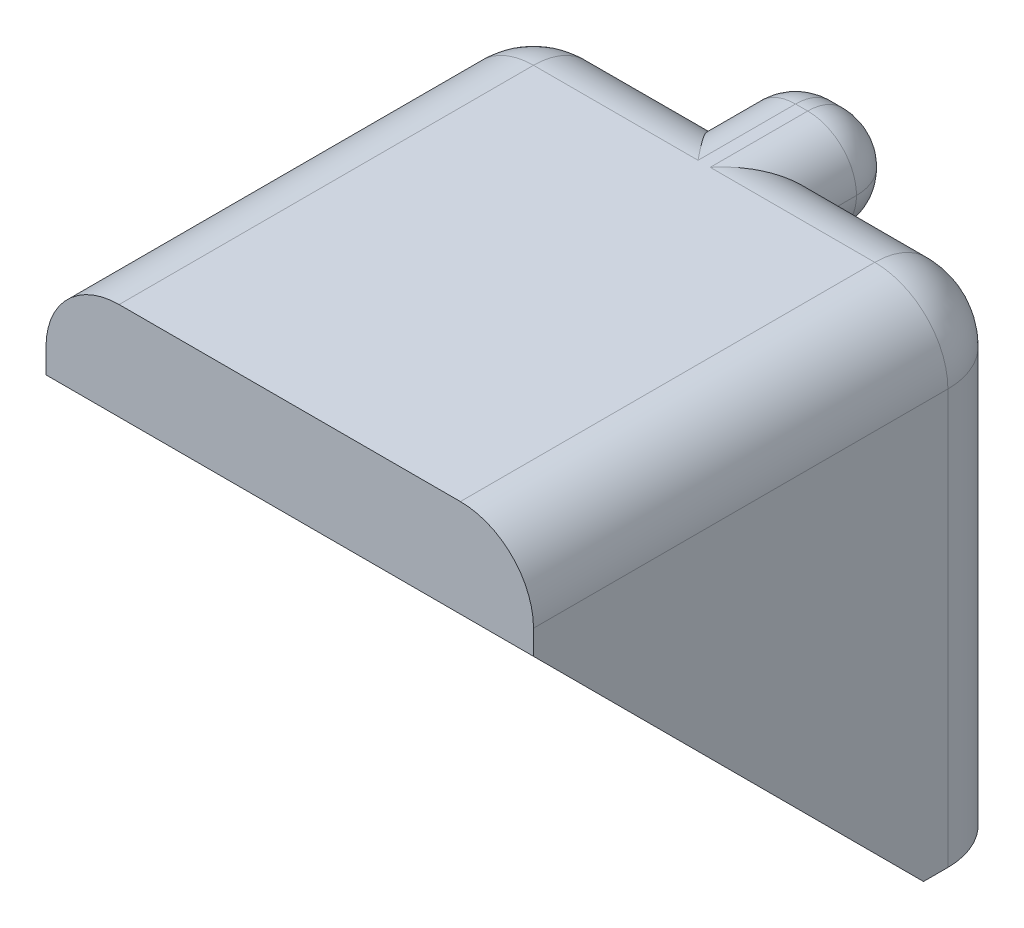
ISO-10303-21;
HEADER;
FILE_DESCRIPTION(('STEP AP214'),'2;1');
FILE_NAME('part.step','',(''),(''),'','','');
FILE_SCHEMA(('AUTOMOTIVE_DESIGN { 1 0 10303 214 1 1 1 1 }'));
ENDSEC;
DATA;
#1=APPLICATION_CONTEXT('core data for automotive mechanical design processes');
#2=APPLICATION_PROTOCOL_DEFINITION('international standard','automotive_design',2000,#1);
#3=PRODUCT_CONTEXT('',#1,'mechanical');
#4=PRODUCT('Part','Part','',(#3));
#5=PRODUCT_RELATED_PRODUCT_CATEGORY('part','',(#4));
#6=PRODUCT_DEFINITION_FORMATION('','',#4);
#7=PRODUCT_DEFINITION_CONTEXT('part definition',#1,'design');
#8=PRODUCT_DEFINITION('design','',#6,#7);
#9=PRODUCT_DEFINITION_SHAPE('','',#8);
#10=(LENGTH_UNIT() NAMED_UNIT(*) SI_UNIT(.MILLI.,.METRE.));
#11=(NAMED_UNIT(*) PLANE_ANGLE_UNIT() SI_UNIT($,.RADIAN.));
#12=(NAMED_UNIT(*) SI_UNIT($,.STERADIAN.) SOLID_ANGLE_UNIT());
#13=UNCERTAINTY_MEASURE_WITH_UNIT(LENGTH_MEASURE(1.E-05),#10,'distance_accuracy_value','');
#14=(GEOMETRIC_REPRESENTATION_CONTEXT(3) GLOBAL_UNCERTAINTY_ASSIGNED_CONTEXT((#13)) GLOBAL_UNIT_ASSIGNED_CONTEXT((#10,
#11,#12)) REPRESENTATION_CONTEXT('',''));
#15=CARTESIAN_POINT('',(0.,0.,0.));
#16=DIRECTION('',(0.,0.,1.));
#17=DIRECTION('',(1.,0.,0.));
#18=AXIS2_PLACEMENT_3D('',#15,#16,#17);
#19=CARTESIAN_POINT('',(0.,0.,4.));
#20=DIRECTION('',(0.,0.,-1.));
#21=DIRECTION('',(-1.,0.,0.));
#22=AXIS2_PLACEMENT_3D('',#19,#20,#21);
#23=PLANE('',#22);
#24=CARTESIAN_POINT('',(0.,-4.,4.));
#25=DIRECTION('',(0.,0.,1.));
#26=DIRECTION('',(1.,0.,0.));
#27=AXIS2_PLACEMENT_3D('',#24,#25,#26);
#28=CIRCLE('',#27,2.);
#29=CARTESIAN_POINT('',(2.,-4.,4.));
#30=VERTEX_POINT('',#29);
#31=EDGE_CURVE('E399',#30,#30,#28,.T.);
#32=ORIENTED_EDGE('',*,*,#31,.F.);
#33=EDGE_LOOP('',(#32));
#34=FACE_BOUND('',#33,.T.);
#35=DIRECTION('',(1.,0.,0.));
#36=VECTOR('',#35,1.);
#37=CARTESIAN_POINT('',(10.,-9.99999999999999,4.));
#38=LINE('',#37,#36);
#39=CARTESIAN_POINT('',(-6.,-10.,4.));
#40=VERTEX_POINT('',#39);
#41=CARTESIAN_POINT('',(6.,-9.99999999999999,4.));
#42=VERTEX_POINT('',#41);
#43=EDGE_CURVE('E407',#40,#42,#38,.T.);
#44=ORIENTED_EDGE('',*,*,#43,.T.);
#45=DIRECTION('',(0.,1.,0.));
#46=VECTOR('',#45,1.);
#47=CARTESIAN_POINT('',(6.,6.00000000000001,4.));
#48=LINE('',#47,#46);
#49=CARTESIAN_POINT('',(6.,6.00000000000001,4.));
#50=VERTEX_POINT('',#49);
#51=EDGE_CURVE('E528',#42,#50,#48,.T.);
#52=ORIENTED_EDGE('',*,*,#51,.T.);
#53=DIRECTION('',(1.,0.,0.));
#54=VECTOR('',#53,1.);
#55=CARTESIAN_POINT('',(0.,6.,4.));
#56=LINE('',#55,#54);
#57=CARTESIAN_POINT('',(-6.,6.,4.));
#58=VERTEX_POINT('',#57);
#59=EDGE_CURVE('E392',#58,#50,#56,.T.);
#60=ORIENTED_EDGE('',*,*,#59,.F.);
#61=DIRECTION('',(0.,-1.,0.));
#62=VECTOR('',#61,1.);
#63=CARTESIAN_POINT('',(-6.,6.,4.));
#64=LINE('',#63,#62);
#65=EDGE_CURVE('E514',#58,#40,#64,.T.);
#66=ORIENTED_EDGE('',*,*,#65,.T.);
#67=EDGE_LOOP('',(#44,#52,#60,#66));
#68=FACE_BOUND('',#67,.T.);
#69=ADVANCED_FACE('F37',(#34,#68),#23,.F.);
#70=CARTESIAN_POINT('',(0.,0.,0.));
#71=DIRECTION('',(0.,0.,-1.));
#72=DIRECTION('',(-1.,0.,0.));
#73=AXIS2_PLACEMENT_3D('',#70,#71,#72);
#74=PLANE('',#73);
#75=DIRECTION('',(1.,0.,0.));
#76=VECTOR('',#75,1.);
#77=CARTESIAN_POINT('',(10.,-9.99999999999999,0.));
#78=LINE('',#77,#76);
#79=CARTESIAN_POINT('',(-7.,-10.,0.));
#80=VERTEX_POINT('',#79);
#81=CARTESIAN_POINT('',(7.,-9.99999999999999,0.));
#82=VERTEX_POINT('',#81);
#83=EDGE_CURVE('E402',#80,#82,#78,.T.);
#84=ORIENTED_EDGE('',*,*,#83,.F.);
#85=DIRECTION('',(0.,-1.,0.));
#86=VECTOR('',#85,1.);
#87=CARTESIAN_POINT('',(-7.,10.,0.));
#88=LINE('',#87,#86);
#89=CARTESIAN_POINT('',(-7.,7.,0.));
#90=VERTEX_POINT('',#89);
#91=EDGE_CURVE('E353',#80,#90,#88,.F.);
#92=ORIENTED_EDGE('',*,*,#91,.T.);
#93=DIRECTION('',(-1.,0.,0.));
#94=VECTOR('',#93,1.);
#95=CARTESIAN_POINT('',(-2.25,7.,0.));
#96=LINE('',#95,#94);
#97=CARTESIAN_POINT('',(-1.98205080756888,7.,0.));
#98=VERTEX_POINT('',#97);
#99=EDGE_CURVE('E426',#90,#98,#96,.F.);
#100=ORIENTED_EDGE('',*,*,#99,.T.);
#101=CARTESIAN_POINT('',(-0.25,8.,0.));
#102=DIRECTION('',(0.,0.,-1.));
#103=DIRECTION('',(-1.,0.,0.));
#104=AXIS2_PLACEMENT_3D('',#101,#102,#103);
#105=CIRCLE('',#104,2.);
#106=CARTESIAN_POINT('',(-0.25,6.,0.));
#107=VERTEX_POINT('',#106);
#108=EDGE_CURVE('E235',#98,#107,#105,.F.);
#109=ORIENTED_EDGE('',*,*,#108,.T.);
#110=DIRECTION('',(-1.,0.,0.));
#111=VECTOR('',#110,1.);
#112=CARTESIAN_POINT('',(2.25,6.,0.));
#113=LINE('',#112,#111);
#114=CARTESIAN_POINT('',(0.249999999999999,6.,0.));
#115=VERTEX_POINT('',#114);
#116=EDGE_CURVE('E332',#115,#107,#113,.T.);
#117=ORIENTED_EDGE('',*,*,#116,.F.);
#118=CARTESIAN_POINT('',(0.25,8.,0.));
#119=DIRECTION('',(0.,0.,-1.));
#120=DIRECTION('',(-1.,0.,0.));
#121=AXIS2_PLACEMENT_3D('',#118,#119,#120);
#122=CIRCLE('',#121,2.);
#123=CARTESIAN_POINT('',(1.98205080756888,7.,0.));
#124=VERTEX_POINT('',#123);
#125=EDGE_CURVE('E191',#115,#124,#122,.F.);
#126=ORIENTED_EDGE('',*,*,#125,.T.);
#127=DIRECTION('',(-1.,0.,0.));
#128=VECTOR('',#127,1.);
#129=CARTESIAN_POINT('',(10.,7.00000000000001,0.));
#130=LINE('',#129,#128);
#131=CARTESIAN_POINT('',(7.,7.,0.));
#132=VERTEX_POINT('',#131);
#133=EDGE_CURVE('E57',#124,#132,#130,.F.);
#134=ORIENTED_EDGE('',*,*,#133,.T.);
#135=DIRECTION('',(0.,1.,0.));
#136=VECTOR('',#135,1.);
#137=CARTESIAN_POINT('',(7.,-9.99999999999999,0.));
#138=LINE('',#137,#136);
#139=EDGE_CURVE('E424',#132,#82,#138,.F.);
#140=ORIENTED_EDGE('',*,*,#139,.T.);
#141=EDGE_LOOP('',(#84,#92,#100,#109,#117,#126,#134,#140));
#142=FACE_BOUND('',#141,.T.);
#143=CARTESIAN_POINT('',(0.,-4.,0.));
#144=DIRECTION('',(0.,0.,1.));
#145=DIRECTION('',(1.,0.,0.));
#146=AXIS2_PLACEMENT_3D('',#143,#144,#145);
#147=CIRCLE('',#146,2.);
#148=CARTESIAN_POINT('',(2.,-4.,0.));
#149=VERTEX_POINT('',#148);
#150=EDGE_CURVE('E398',#149,#149,#147,.T.);
#151=ORIENTED_EDGE('',*,*,#150,.T.);
#152=EDGE_LOOP('',(#151));
#153=FACE_BOUND('',#152,.T.);
#154=ADVANCED_FACE('F279',(#142,#153),#74,.T.);
#155=CARTESIAN_POINT('',(-10.,10.,4.));
#156=DIRECTION('',(1.,0.,0.));
#157=DIRECTION('',(0.,1.,0.));
#158=AXIS2_PLACEMENT_3D('',#155,#156,#157);
#159=PLANE('',#158);
#160=DIRECTION('',(0.,0.,-1.));
#161=VECTOR('',#160,1.);
#162=CARTESIAN_POINT('',(-10.,7.,4.));
#163=LINE('',#162,#161);
#164=CARTESIAN_POINT('',(-10.,7.,20.));
#165=VERTEX_POINT('',#164);
#166=CARTESIAN_POINT('',(-10.,7.,3.));
#167=VERTEX_POINT('',#166);
#168=EDGE_CURVE('E414',#165,#167,#163,.T.);
#169=ORIENTED_EDGE('',*,*,#168,.T.);
#170=DIRECTION('',(0.,-1.,0.));
#171=VECTOR('',#170,1.);
#172=CARTESIAN_POINT('',(-10.,-10.,3.));
#173=LINE('',#172,#171);
#174=CARTESIAN_POINT('',(-10.,-10.,3.));
#175=VERTEX_POINT('',#174);
#176=EDGE_CURVE('E416',#167,#175,#173,.T.);
#177=ORIENTED_EDGE('',*,*,#176,.T.);
#178=DIRECTION('',(0.,0.,-1.));
#179=VECTOR('',#178,1.);
#180=CARTESIAN_POINT('',(-10.,-10.,4.));
#181=LINE('',#180,#179);
#182=CARTESIAN_POINT('',(-10.,-10.,4.));
#183=VERTEX_POINT('',#182);
#184=EDGE_CURVE('E411',#183,#175,#181,.T.);
#185=ORIENTED_EDGE('',*,*,#184,.F.);
#186=DIRECTION('',(0.,0.707106781186548,0.707106781186548));
#187=VECTOR('',#186,1.);
#188=CARTESIAN_POINT('',(-10.,-10.,4.));
#189=LINE('',#188,#187);
#190=CARTESIAN_POINT('',(-10.,6.,20.));
#191=VERTEX_POINT('',#190);
#192=EDGE_CURVE('E512',#183,#191,#189,.T.);
#193=ORIENTED_EDGE('',*,*,#192,.T.);
#194=DIRECTION('',(0.,1.,0.));
#195=VECTOR('',#194,1.);
#196=CARTESIAN_POINT('',(-10.,6.,20.));
#197=LINE('',#196,#195);
#198=EDGE_CURVE('E393',#191,#165,#197,.T.);
#199=ORIENTED_EDGE('',*,*,#198,.T.);
#200=EDGE_LOOP('',(#169,#177,#185,#193,#199));
#201=FACE_BOUND('',#200,.T.);
#202=ADVANCED_FACE('F285',(#201),#159,.F.);
#203=CARTESIAN_POINT('',(10.,-9.99999999999999,4.));
#204=DIRECTION('',(0.,1.,0.));
#205=DIRECTION('',(-1.,0.,0.));
#206=AXIS2_PLACEMENT_3D('',#203,#204,#205);
#207=PLANE('',#206);
#208=ORIENTED_EDGE('',*,*,#184,.T.);
#209=CARTESIAN_POINT('',(-7.,-10.,3.));
#210=DIRECTION('',(0.,1.,0.));
#211=DIRECTION('',(-1.,0.,0.));
#212=AXIS2_PLACEMENT_3D('',#209,#210,#211);
#213=CIRCLE('',#212,3.);
#214=EDGE_CURVE('E421',#175,#80,#213,.F.);
#215=ORIENTED_EDGE('',*,*,#214,.T.);
#216=ORIENTED_EDGE('',*,*,#83,.T.);
#217=CARTESIAN_POINT('',(7.,-9.99999999999999,3.));
#218=DIRECTION('',(0.,1.,0.));
#219=DIRECTION('',(-1.,0.,0.));
#220=AXIS2_PLACEMENT_3D('',#217,#218,#219);
#221=CIRCLE('',#220,3.);
#222=CARTESIAN_POINT('',(10.,-9.99999999999999,3.));
#223=VERTEX_POINT('',#222);
#224=EDGE_CURVE('E419',#82,#223,#221,.F.);
#225=ORIENTED_EDGE('',*,*,#224,.T.);
#226=DIRECTION('',(0.,0.,-1.));
#227=VECTOR('',#226,1.);
#228=CARTESIAN_POINT('',(10.,-9.99999999999999,4.));
#229=LINE('',#228,#227);
#230=CARTESIAN_POINT('',(10.,-9.99999999999999,4.));
#231=VERTEX_POINT('',#230);
#232=EDGE_CURVE('E358',#231,#223,#229,.T.);
#233=ORIENTED_EDGE('',*,*,#232,.F.);
#234=DIRECTION('',(1.,0.,0.));
#235=VECTOR('',#234,1.);
#236=CARTESIAN_POINT('',(6.,-9.99999999999999,4.));
#237=LINE('',#236,#235);
#238=EDGE_CURVE('E91',#42,#231,#237,.T.);
#239=ORIENTED_EDGE('',*,*,#238,.F.);
#240=ORIENTED_EDGE('',*,*,#43,.F.);
#241=EDGE_CURVE('E405',#183,#40,#38,.T.);
#242=ORIENTED_EDGE('',*,*,#241,.F.);
#243=EDGE_LOOP('',(#208,#215,#216,#225,#233,#239,#240,#242));
#244=FACE_BOUND('',#243,.T.);
#245=ADVANCED_FACE('F300',(#244),#207,.F.);
#246=CARTESIAN_POINT('',(10.,10.,4.));
#247=DIRECTION('',(-1.,0.,0.));
#248=DIRECTION('',(0.,-1.,0.));
#249=AXIS2_PLACEMENT_3D('',#246,#247,#248);
#250=PLANE('',#249);
#251=ORIENTED_EDGE('',*,*,#232,.T.);
#252=DIRECTION('',(0.,1.,0.));
#253=VECTOR('',#252,1.);
#254=CARTESIAN_POINT('',(10.,10.,3.));
#255=LINE('',#254,#253);
#256=CARTESIAN_POINT('',(10.,7.,3.));
#257=VERTEX_POINT('',#256);
#258=EDGE_CURVE('E352',#223,#257,#255,.T.);
#259=ORIENTED_EDGE('',*,*,#258,.T.);
#260=DIRECTION('',(0.,0.,-1.));
#261=VECTOR('',#260,1.);
#262=CARTESIAN_POINT('',(10.,7.,4.));
#263=LINE('',#262,#261);
#264=CARTESIAN_POINT('',(10.,7.,20.));
#265=VERTEX_POINT('',#264);
#266=EDGE_CURVE('E348',#257,#265,#263,.F.);
#267=ORIENTED_EDGE('',*,*,#266,.T.);
#268=DIRECTION('',(0.,1.,0.));
#269=VECTOR('',#268,1.);
#270=CARTESIAN_POINT('',(10.,6.00000000000001,20.));
#271=LINE('',#270,#269);
#272=CARTESIAN_POINT('',(10.,6.00000000000001,20.));
#273=VERTEX_POINT('',#272);
#274=EDGE_CURVE('E379',#273,#265,#271,.T.);
#275=ORIENTED_EDGE('',*,*,#274,.F.);
#276=DIRECTION('',(0.,-0.707106781186548,-0.707106781186548));
#277=VECTOR('',#276,1.);
#278=CARTESIAN_POINT('',(10.,-9.99999999999999,4.));
#279=LINE('',#278,#277);
#280=EDGE_CURVE('E523',#273,#231,#279,.T.);
#281=ORIENTED_EDGE('',*,*,#280,.T.);
#282=EDGE_LOOP('',(#251,#259,#267,#275,#281));
#283=FACE_BOUND('',#282,.T.);
#284=ADVANCED_FACE('F297',(#283),#250,.F.);
#285=CARTESIAN_POINT('',(10.,10.,4.));
#286=DIRECTION('',(0.,-1.,0.));
#287=DIRECTION('',(1.,0.,0.));
#288=AXIS2_PLACEMENT_3D('',#285,#286,#287);
#289=PLANE('',#288);
#290=DIRECTION('',(0.,0.,1.));
#291=VECTOR('',#290,1.);
#292=CARTESIAN_POINT('',(-0.249999999999999,10.,4.));
#293=LINE('',#292,#291);
#294=CARTESIAN_POINT('',(-0.249999999999999,10.,-1.));
#295=VERTEX_POINT('',#294);
#296=CARTESIAN_POINT('',(-0.249999999999999,10.,3.));
#297=VERTEX_POINT('',#296);
#298=EDGE_CURVE('E211',#295,#297,#293,.T.);
#299=ORIENTED_EDGE('',*,*,#298,.T.);
#300=DIRECTION('',(-1.,0.,0.));
#301=VECTOR('',#300,1.);
#302=CARTESIAN_POINT('',(-10.,10.,3.));
#303=LINE('',#302,#301);
#304=CARTESIAN_POINT('',(-7.,10.,3.));
#305=VERTEX_POINT('',#304);
#306=EDGE_CURVE('E368',#297,#305,#303,.T.);
#307=ORIENTED_EDGE('',*,*,#306,.T.);
#308=DIRECTION('',(0.,0.,-1.));
#309=VECTOR('',#308,1.);
#310=CARTESIAN_POINT('',(-7.,10.,4.));
#311=LINE('',#310,#309);
#312=CARTESIAN_POINT('',(-7.,10.,20.));
#313=VERTEX_POINT('',#312);
#314=EDGE_CURVE('E370',#305,#313,#311,.F.);
#315=ORIENTED_EDGE('',*,*,#314,.T.);
#316=DIRECTION('',(1.,0.,0.));
#317=VECTOR('',#316,1.);
#318=CARTESIAN_POINT('',(-10.,10.,20.));
#319=LINE('',#318,#317);
#320=CARTESIAN_POINT('',(7.,10.,20.));
#321=VERTEX_POINT('',#320);
#322=EDGE_CURVE('E376',#313,#321,#319,.T.);
#323=ORIENTED_EDGE('',*,*,#322,.T.);
#324=DIRECTION('',(0.,0.,-1.));
#325=VECTOR('',#324,1.);
#326=CARTESIAN_POINT('',(7.,10.,4.));
#327=LINE('',#326,#325);
#328=CARTESIAN_POINT('',(7.,10.,3.));
#329=VERTEX_POINT('',#328);
#330=EDGE_CURVE('E361',#321,#329,#327,.T.);
#331=ORIENTED_EDGE('',*,*,#330,.T.);
#332=DIRECTION('',(-1.,0.,0.));
#333=VECTOR('',#332,1.);
#334=CARTESIAN_POINT('',(2.25,10.,3.));
#335=LINE('',#334,#333);
#336=CARTESIAN_POINT('',(0.25,10.,3.));
#337=VERTEX_POINT('',#336);
#338=EDGE_CURVE('E363',#329,#337,#335,.T.);
#339=ORIENTED_EDGE('',*,*,#338,.T.);
#340=DIRECTION('',(0.,0.,1.));
#341=VECTOR('',#340,1.);
#342=CARTESIAN_POINT('',(0.25,10.,4.));
#343=LINE('',#342,#341);
#344=CARTESIAN_POINT('',(0.25,10.,-1.));
#345=VERTEX_POINT('',#344);
#346=EDGE_CURVE('E203',#337,#345,#343,.F.);
#347=ORIENTED_EDGE('',*,*,#346,.T.);
#348=DIRECTION('',(1.,0.,0.));
#349=VECTOR('',#348,1.);
#350=CARTESIAN_POINT('',(-2.25,10.,-1.));
#351=LINE('',#350,#349);
#352=EDGE_CURVE('E208',#345,#295,#351,.F.);
#353=ORIENTED_EDGE('',*,*,#352,.T.);
#354=EDGE_LOOP('',(#299,#307,#315,#323,#331,#339,#347,#353));
#355=FACE_BOUND('',#354,.T.);
#356=ADVANCED_FACE('F294',(#355),#289,.F.);
#357=CARTESIAN_POINT('',(0.,-4.,4.));
#358=DIRECTION('',(0.,0.,-1.));
#359=DIRECTION('',(-1.,0.,0.));
#360=AXIS2_PLACEMENT_3D('',#357,#358,#359);
#361=CYLINDRICAL_SURFACE('',#360,2.);
#362=ORIENTED_EDGE('',*,*,#31,.T.);
#363=EDGE_LOOP('',(#362));
#364=FACE_BOUND('',#363,.T.);
#365=ORIENTED_EDGE('',*,*,#150,.F.);
#366=EDGE_LOOP('',(#365));
#367=FACE_BOUND('',#366,.T.);
#368=ADVANCED_FACE('F291',(#364,#367),#361,.F.);
#369=CARTESIAN_POINT('',(0.,6.,0.));
#370=DIRECTION('',(0.,1.,0.));
#371=DIRECTION('',(-1.,0.,0.));
#372=AXIS2_PLACEMENT_3D('',#369,#370,#371);
#373=PLANE('',#372);
#374=ORIENTED_EDGE('',*,*,#59,.T.);
#375=DIRECTION('',(0.,0.,1.));
#376=VECTOR('',#375,1.);
#377=CARTESIAN_POINT('',(6.,6.00000000000001,20.));
#378=LINE('',#377,#376);
#379=CARTESIAN_POINT('',(6.,6.00000000000001,20.));
#380=VERTEX_POINT('',#379);
#381=EDGE_CURVE('E521',#50,#380,#378,.T.);
#382=ORIENTED_EDGE('',*,*,#381,.T.);
#383=DIRECTION('',(1.,0.,0.));
#384=VECTOR('',#383,1.);
#385=CARTESIAN_POINT('',(-10.,6.,20.));
#386=LINE('',#385,#384);
#387=CARTESIAN_POINT('',(-6.,6.,20.));
#388=VERTEX_POINT('',#387);
#389=EDGE_CURVE('E380',#388,#380,#386,.T.);
#390=ORIENTED_EDGE('',*,*,#389,.F.);
#391=DIRECTION('',(0.,0.,-1.));
#392=VECTOR('',#391,1.);
#393=CARTESIAN_POINT('',(-6.,6.,20.));
#394=LINE('',#393,#392);
#395=EDGE_CURVE('E381',#388,#58,#394,.T.);
#396=ORIENTED_EDGE('',*,*,#395,.T.);
#397=EDGE_LOOP('',(#374,#382,#390,#396));
#398=FACE_BOUND('',#397,.T.);
#399=ADVANCED_FACE('F550',(#398),#373,.F.);
#400=CARTESIAN_POINT('',(-10.,6.,20.));
#401=DIRECTION('',(0.,0.,1.));
#402=DIRECTION('',(1.,0.,0.));
#403=AXIS2_PLACEMENT_3D('',#400,#401,#402);
#404=PLANE('',#403);
#405=ORIENTED_EDGE('',*,*,#322,.F.);
#406=CARTESIAN_POINT('',(-7.,7.,20.));
#407=DIRECTION('',(0.,0.,1.));
#408=DIRECTION('',(1.,0.,0.));
#409=AXIS2_PLACEMENT_3D('',#406,#407,#408);
#410=CIRCLE('',#409,3.);
#411=EDGE_CURVE('E209',#313,#165,#410,.T.);
#412=ORIENTED_EDGE('',*,*,#411,.T.);
#413=ORIENTED_EDGE('',*,*,#198,.F.);
#414=EDGE_CURVE('E384',#191,#388,#386,.T.);
#415=ORIENTED_EDGE('',*,*,#414,.T.);
#416=ORIENTED_EDGE('',*,*,#389,.T.);
#417=DIRECTION('',(1.,0.,0.));
#418=VECTOR('',#417,1.);
#419=CARTESIAN_POINT('',(6.,6.00000000000001,20.));
#420=LINE('',#419,#418);
#421=EDGE_CURVE('E515',#380,#273,#420,.T.);
#422=ORIENTED_EDGE('',*,*,#421,.T.);
#423=ORIENTED_EDGE('',*,*,#274,.T.);
#424=CARTESIAN_POINT('',(7.,7.,20.));
#425=DIRECTION('',(0.,0.,1.));
#426=DIRECTION('',(1.,0.,0.));
#427=AXIS2_PLACEMENT_3D('',#424,#425,#426);
#428=CIRCLE('',#427,3.);
#429=EDGE_CURVE('E213',#265,#321,#428,.T.);
#430=ORIENTED_EDGE('',*,*,#429,.T.);
#431=EDGE_LOOP('',(#405,#412,#413,#415,#416,#422,#423,#430));
#432=FACE_BOUND('',#431,.T.);
#433=ADVANCED_FACE('F375',(#432),#404,.T.);
#434=CARTESIAN_POINT('',(-6.,-10.,4.));
#435=DIRECTION('',(0.,-0.707106781186547,0.707106781186547));
#436=DIRECTION('',(0.,-0.707106781186548,-0.707106781186548));
#437=AXIS2_PLACEMENT_3D('',#434,#435,#436);
#438=PLANE('',#437);
#439=ORIENTED_EDGE('',*,*,#192,.F.);
#440=ORIENTED_EDGE('',*,*,#241,.T.);
#441=DIRECTION('',(0.,0.707106781186548,0.707106781186548));
#442=VECTOR('',#441,1.);
#443=CARTESIAN_POINT('',(-6.,-10.,4.));
#444=LINE('',#443,#442);
#445=EDGE_CURVE('E387',#40,#388,#444,.T.);
#446=ORIENTED_EDGE('',*,*,#445,.T.);
#447=ORIENTED_EDGE('',*,*,#414,.F.);
#448=EDGE_LOOP('',(#439,#440,#446,#447));
#449=FACE_BOUND('',#448,.T.);
#450=ADVANCED_FACE('F511',(#449),#438,.T.);
#451=CARTESIAN_POINT('',(-6.,0.,0.));
#452=DIRECTION('',(1.,0.,0.));
#453=DIRECTION('',(0.,0.,-1.));
#454=AXIS2_PLACEMENT_3D('',#451,#452,#453);
#455=PLANE('',#454);
#456=ORIENTED_EDGE('',*,*,#65,.F.);
#457=ORIENTED_EDGE('',*,*,#395,.F.);
#458=ORIENTED_EDGE('',*,*,#445,.F.);
#459=EDGE_LOOP('',(#456,#457,#458));
#460=FACE_BOUND('',#459,.T.);
#461=ADVANCED_FACE('F544',(#460),#455,.T.);
#462=CARTESIAN_POINT('',(6.,-9.99999999999999,4.));
#463=DIRECTION('',(0.,-0.707106781186547,0.707106781186547));
#464=DIRECTION('',(0.,-0.707106781186548,-0.707106781186548));
#465=AXIS2_PLACEMENT_3D('',#462,#463,#464);
#466=PLANE('',#465);
#467=ORIENTED_EDGE('',*,*,#280,.F.);
#468=ORIENTED_EDGE('',*,*,#421,.F.);
#469=DIRECTION('',(0.,-0.707106781186548,-0.707106781186548));
#470=VECTOR('',#469,1.);
#471=CARTESIAN_POINT('',(6.,-9.99999999999999,4.));
#472=LINE('',#471,#470);
#473=EDGE_CURVE('E525',#380,#42,#472,.T.);
#474=ORIENTED_EDGE('',*,*,#473,.T.);
#475=ORIENTED_EDGE('',*,*,#238,.T.);
#476=EDGE_LOOP('',(#467,#468,#474,#475));
#477=FACE_BOUND('',#476,.T.);
#478=ADVANCED_FACE('F538',(#477),#466,.T.);
#479=CARTESIAN_POINT('',(6.,0.,0.));
#480=DIRECTION('',(-1.,0.,0.));
#481=DIRECTION('',(0.,0.,1.));
#482=AXIS2_PLACEMENT_3D('',#479,#480,#481);
#483=PLANE('',#482);
#484=ORIENTED_EDGE('',*,*,#473,.F.);
#485=ORIENTED_EDGE('',*,*,#381,.F.);
#486=ORIENTED_EDGE('',*,*,#51,.F.);
#487=EDGE_LOOP('',(#484,#485,#486));
#488=FACE_BOUND('',#487,.T.);
#489=ADVANCED_FACE('F533',(#488),#483,.T.);
#490=CARTESIAN_POINT('',(2.25,6.,-3.));
#491=DIRECTION('',(0.,1.,0.));
#492=DIRECTION('',(-1.,0.,0.));
#493=AXIS2_PLACEMENT_3D('',#490,#491,#492);
#494=PLANE('',#493);
#495=ORIENTED_EDGE('',*,*,#116,.T.);
#496=DIRECTION('',(0.,0.,1.));
#497=VECTOR('',#496,1.);
#498=CARTESIAN_POINT('',(-0.25,6.,-3.));
#499=LINE('',#498,#497);
#500=CARTESIAN_POINT('',(-0.25,6.,-1.));
#501=VERTEX_POINT('',#500);
#502=EDGE_CURVE('E225',#107,#501,#499,.F.);
#503=ORIENTED_EDGE('',*,*,#502,.T.);
#504=DIRECTION('',(-1.,0.,0.));
#505=VECTOR('',#504,1.);
#506=CARTESIAN_POINT('',(2.25,6.,-1.));
#507=LINE('',#506,#505);
#508=CARTESIAN_POINT('',(0.249999999999999,6.,-1.));
#509=VERTEX_POINT('',#508);
#510=EDGE_CURVE('E223',#501,#509,#507,.F.);
#511=ORIENTED_EDGE('',*,*,#510,.T.);
#512=DIRECTION('',(0.,0.,1.));
#513=VECTOR('',#512,1.);
#514=CARTESIAN_POINT('',(0.249999999999999,6.,-3.));
#515=LINE('',#514,#513);
#516=EDGE_CURVE('E221',#509,#115,#515,.T.);
#517=ORIENTED_EDGE('',*,*,#516,.T.);
#518=EDGE_LOOP('',(#495,#503,#511,#517));
#519=FACE_BOUND('',#518,.T.);
#520=ADVANCED_FACE('F243',(#519),#494,.F.);
#521=CARTESIAN_POINT('',(10.,7.00000000000001,3.));
#522=DIRECTION('',(1.,0.,0.));
#523=DIRECTION('',(0.,1.,0.));
#524=AXIS2_PLACEMENT_3D('',#521,#522,#523);
#525=CYLINDRICAL_SURFACE('',#524,3.);
#526=ORIENTED_EDGE('',*,*,#306,.F.);
#527=CARTESIAN_POINT('',(-2.25,8.,0.17157287525381));
#528=CARTESIAN_POINT('',(-2.25000844496491,8.05638405555257,0.19149294973119));
#529=CARTESIAN_POINT('',(-2.24761652904293,8.11213090524145,0.213113026951954));
#530=CARTESIAN_POINT('',(-2.23841610313972,8.22185097214105,0.259452787780402));
#531=CARTESIAN_POINT('',(-2.23161435571982,8.275826772357,0.28416767868531));
#532=CARTESIAN_POINT('',(-2.21406500896449,8.38114703210529,0.336195675457499));
#533=CARTESIAN_POINT('',(-2.20335787821592,8.43251253251163,0.363480077625334));
#534=CARTESIAN_POINT('',(-2.17838334308601,8.53293300898972,0.420570081191318));
#535=CARTESIAN_POINT('',(-2.16411426132943,8.58198688350808,0.450376866033002));
#536=CARTESIAN_POINT('',(-2.10932690635692,8.74710684622474,0.55723520480667));
#537=CARTESIAN_POINT('',(-2.06079912360125,8.85695114231588,0.639990691269773));
#538=CARTESIAN_POINT('',(-1.94957987089101,9.06066196172696,0.815528183344868));
#539=CARTESIAN_POINT('',(-1.88682567502974,9.15445439532711,0.908353613562805));
#540=CARTESIAN_POINT('',(-1.72493331699463,9.3592572036304,1.13830760334613));
#541=CARTESIAN_POINT('',(-1.62111021202543,9.46289727870954,1.27868584193729));
#542=CARTESIAN_POINT('',(-1.40129157205659,9.64153331793483,1.56777829054137));
#543=CARTESIAN_POINT('',(-1.28527922818272,9.7164890478937,1.71650387636297));
#544=CARTESIAN_POINT('',(-1.09324192747759,9.81536669032299,1.9591137223494));
#545=CARTESIAN_POINT('',(-1.01950503352198,9.84775479636274,2.05147691559191));
#546=CARTESIAN_POINT('',(-0.870125047523167,9.90310220476016,2.23748721104573));
#547=CARTESIAN_POINT('',(-0.794481334381547,9.92605839166328,2.33113472694329));
#548=CARTESIAN_POINT('',(-0.566065975658875,9.98105514873023,2.61289025053771));
#549=CARTESIAN_POINT('',(-0.411349142273706,9.99945340633408,2.80238832588658));
#550=CARTESIAN_POINT('',(-0.254618731356967,9.99999599518123,2.99434323024007));
#551=CARTESIAN_POINT('',(-0.25230932774503,9.99999999478465,2.99717166041597));
#552=CARTESIAN_POINT('',(-0.249999999999999,10.,3.));
#553=B_SPLINE_CURVE_WITH_KNOTS('',3,(#527,#528,#529,#530,#531,#532,#533,#534,#535,#536,#537,
#538,#539,#540,#541,#542,#543,#544,#545,#546,#547,#548,#549,#550,#551,#552),.UNSPECIFIED.,.F.,
.F.,(4,2,2,2,2,2,2,2,2,2,2,2,4),(0.,0.179272158824227,0.35827004854172,0.535463494925257,
0.71274054225016,1.14766579663324,1.58454732757419,2.19039501983592,2.79708941843105,
3.16434808038176,3.53172795410126,4.2641894371729,4.2751438948957),.UNSPECIFIED.);
#554=CARTESIAN_POINT('',(-2.25,8.,0.17157287525381));
#555=VERTEX_POINT('',#554);
#556=EDGE_CURVE('E48',#297,#555,#553,.F.);
#557=ORIENTED_EDGE('',*,*,#556,.T.);
#558=CARTESIAN_POINT('',(-2.25,8.,0.17157287525381));
#559=CARTESIAN_POINT('',(-2.25000821888706,7.95355248103705,0.155141126861067));
#560=CARTESIAN_POINT('',(-2.24838197663285,7.90668707539097,0.139868821218259));
#561=CARTESIAN_POINT('',(-2.24174679524301,7.81247065455861,0.111696897099553));
#562=CARTESIAN_POINT('',(-2.23673683302909,7.76511949676916,0.0987979977317692));
#563=CARTESIAN_POINT('',(-2.22339437708095,7.671531339748,0.0757375731694859));
#564=CARTESIAN_POINT('',(-2.21515079027866,7.6252970587466,0.0655140960980813));
#565=CARTESIAN_POINT('',(-2.19531468400848,7.53312123232058,0.0473756568109282));
#566=CARTESIAN_POINT('',(-2.18372315659338,7.48717960429341,0.039460012138639));
#567=CARTESIAN_POINT('',(-2.14845015078399,7.36590749193589,0.0214200005451014));
#568=CARTESIAN_POINT('',(-2.12182905057713,7.29109923378685,0.0132612956365632));
#569=CARTESIAN_POINT('',(-2.07493099710084,7.18068162932429,0.00521002024107492));
#570=CARTESIAN_POINT('',(-2.05791195977834,7.14378282490419,0.00322630791793724));
#571=CARTESIAN_POINT('',(-2.02163956640455,7.07105307292258,0.000621130841331382));
#572=CARTESIAN_POINT('',(-2.00238636024599,7.03522205392472,-4.25245048755565E-07));
#573=CARTESIAN_POINT('',(-1.98205080756888,7.,0.));
#574=B_SPLINE_CURVE_WITH_KNOTS('',3,(#558,#559,#560,#561,#562,#563,#564,#565,#566,#567,#568,
#569,#570,#571,#572,#573),.UNSPECIFIED.,.F.,.F.,(4,2,2,2,2,2,2,4),(0.,0.147773408957545,
0.2955915176798,0.439602078739354,0.583570010678634,0.822125092216768,0.94409291391884,
1.06605255739812),.UNSPECIFIED.);
#575=EDGE_CURVE('E227',#555,#98,#574,.T.);
#576=ORIENTED_EDGE('',*,*,#575,.T.);
#577=ORIENTED_EDGE('',*,*,#99,.F.);
#578=CARTESIAN_POINT('',(-7.,7.,3.));
#579=DIRECTION('',(-1.,0.,0.));
#580=DIRECTION('',(0.,-1.,0.));
#581=AXIS2_PLACEMENT_3D('',#578,#579,#580);
#582=CIRCLE('',#581,3.);
#583=EDGE_CURVE('E325',#305,#90,#582,.T.);
#584=ORIENTED_EDGE('',*,*,#583,.F.);
#585=EDGE_LOOP('',(#526,#557,#576,#577,#584));
#586=FACE_BOUND('',#585,.T.);
#587=ADVANCED_FACE('F237',(#586),#525,.T.);
#588=CARTESIAN_POINT('',(-7.,7.,4.));
#589=DIRECTION('',(0.,0.,-1.));
#590=DIRECTION('',(-1.,0.,0.));
#591=AXIS2_PLACEMENT_3D('',#588,#589,#590);
#592=CYLINDRICAL_SURFACE('',#591,3.);
#593=ORIENTED_EDGE('',*,*,#411,.F.);
#594=ORIENTED_EDGE('',*,*,#314,.F.);
#595=CARTESIAN_POINT('',(-7.,7.,3.));
#596=DIRECTION('',(0.,0.,-1.));
#597=DIRECTION('',(-1.,0.,0.));
#598=AXIS2_PLACEMENT_3D('',#595,#596,#597);
#599=CIRCLE('',#598,3.);
#600=EDGE_CURVE('E323',#167,#305,#599,.T.);
#601=ORIENTED_EDGE('',*,*,#600,.F.);
#602=ORIENTED_EDGE('',*,*,#168,.F.);
#603=EDGE_LOOP('',(#593,#594,#601,#602));
#604=FACE_BOUND('',#603,.T.);
#605=ADVANCED_FACE('F242',(#604),#592,.T.);
#606=CARTESIAN_POINT('',(-7.,7.,3.));
#607=DIRECTION('',(0.,1.,0.));
#608=DIRECTION('',(-1.,0.,0.));
#609=AXIS2_PLACEMENT_3D('',#606,#607,#608);
#610=SPHERICAL_SURFACE('',#609,3.);
#611=ORIENTED_EDGE('',*,*,#600,.T.);
#612=ORIENTED_EDGE('',*,*,#583,.T.);
#613=CARTESIAN_POINT('',(-7.,7.,3.));
#614=DIRECTION('',(0.,1.,0.));
#615=DIRECTION('',(0.,0.,1.));
#616=AXIS2_PLACEMENT_3D('',#613,#614,#615);
#617=CIRCLE('',#616,3.);
#618=EDGE_CURVE('E327',#167,#90,#617,.F.);
#619=ORIENTED_EDGE('',*,*,#618,.F.);
#620=EDGE_LOOP('',(#611,#612,#619));
#621=FACE_BOUND('',#620,.T.);
#622=ADVANCED_FACE('F311',(#621),#610,.T.);
#623=CARTESIAN_POINT('',(-7.,10.,3.));
#624=DIRECTION('',(0.,1.,0.));
#625=DIRECTION('',(-1.,0.,0.));
#626=AXIS2_PLACEMENT_3D('',#623,#624,#625);
#627=CYLINDRICAL_SURFACE('',#626,3.);
#628=ORIENTED_EDGE('',*,*,#618,.T.);
#629=ORIENTED_EDGE('',*,*,#91,.F.);
#630=ORIENTED_EDGE('',*,*,#214,.F.);
#631=ORIENTED_EDGE('',*,*,#176,.F.);
#632=EDGE_LOOP('',(#628,#629,#630,#631));
#633=FACE_BOUND('',#632,.T.);
#634=ADVANCED_FACE('F308',(#633),#627,.T.);
#635=CARTESIAN_POINT('',(7.,7.,4.));
#636=DIRECTION('',(0.,0.,-1.));
#637=DIRECTION('',(-1.,0.,0.));
#638=AXIS2_PLACEMENT_3D('',#635,#636,#637);
#639=CYLINDRICAL_SURFACE('',#638,3.);
#640=ORIENTED_EDGE('',*,*,#429,.F.);
#641=ORIENTED_EDGE('',*,*,#266,.F.);
#642=CARTESIAN_POINT('',(7.,7.00000000000001,3.));
#643=DIRECTION('',(0.,0.,-1.));
#644=DIRECTION('',(-1.,0.,0.));
#645=AXIS2_PLACEMENT_3D('',#642,#643,#644);
#646=CIRCLE('',#645,3.);
#647=EDGE_CURVE('E216',#329,#257,#646,.T.);
#648=ORIENTED_EDGE('',*,*,#647,.F.);
#649=ORIENTED_EDGE('',*,*,#330,.F.);
#650=EDGE_LOOP('',(#640,#641,#648,#649));
#651=FACE_BOUND('',#650,.T.);
#652=ADVANCED_FACE('F310',(#651),#639,.T.);
#653=CARTESIAN_POINT('',(10.,7.00000000000001,3.));
#654=DIRECTION('',(1.,0.,0.));
#655=DIRECTION('',(0.,1.,0.));
#656=AXIS2_PLACEMENT_3D('',#653,#654,#655);
#657=CYLINDRICAL_SURFACE('',#656,3.);
#658=CARTESIAN_POINT('',(1.98205080756888,7.,0.));
#659=CARTESIAN_POINT('',(2.00669290463755,7.0426647877276,-6.818672355187E-06));
#660=CARTESIAN_POINT('',(2.02974718044606,7.08625345454453,0.000910001015395136));
#661=CARTESIAN_POINT('',(2.07255595040707,7.17495036751452,0.00477831535346944));
#662=CARTESIAN_POINT('',(2.09230942905365,7.22005907620544,0.00773043474680093));
#663=CARTESIAN_POINT('',(2.12791236572397,7.31026362997441,0.0157522540101033));
#664=CARTESIAN_POINT('',(2.14384932363508,7.35532984102391,0.0207654143670676));
#665=CARTESIAN_POINT('',(2.17238363064402,7.44618526666786,0.0330111177253506));
#666=CARTESIAN_POINT('',(2.18498197810004,7.49197426077603,0.0402429958555796));
#667=CARTESIAN_POINT('',(2.21399469359959,7.61419558818407,0.0625276753581193));
#668=CARTESIAN_POINT('',(2.22747830740521,7.6909962490042,0.0795972146707852));
#669=CARTESIAN_POINT('',(2.241007516731,7.80649208108124,0.110153149745167));
#670=CARTESIAN_POINT('',(2.24440001743674,7.84546642562183,0.121313646041363));
#671=CARTESIAN_POINT('',(2.24889620938985,7.92304870363574,0.145244609448969));
#672=CARTESIAN_POINT('',(2.25000007373493,7.96165666460007,0.158014954724271));
#673=CARTESIAN_POINT('',(2.25,8.,0.17157287525381));
#674=B_SPLINE_CURVE_WITH_KNOTS('',3,(#658,#659,#660,#661,#662,#663,#664,#665,#666,#667,#668,
#669,#670,#671,#672,#673),.UNSPECIFIED.,.F.,.F.,(4,2,2,2,2,2,2,4),(0.,0.147775603454333,
0.295596587401062,0.439607639584658,0.583575578841567,0.822128370997899,0.944094895011127,
1.0660521939258),.UNSPECIFIED.);
#675=CARTESIAN_POINT('',(2.25,8.,0.17157287525381));
#676=VERTEX_POINT('',#675);
#677=EDGE_CURVE('E185',#124,#676,#674,.T.);
#678=ORIENTED_EDGE('',*,*,#677,.T.);
#679=CARTESIAN_POINT('',(2.25,8.,0.17157287525381));
#680=CARTESIAN_POINT('',(2.25000844496491,8.05638405555257,0.19149294973119));
#681=CARTESIAN_POINT('',(2.24761652904293,8.11213090524145,0.213113026951954));
#682=CARTESIAN_POINT('',(2.23841610313972,8.22185097214105,0.259452787780402));
#683=CARTESIAN_POINT('',(2.23161435571982,8.275826772357,0.284167678685309));
#684=CARTESIAN_POINT('',(2.21406500896449,8.38114703210529,0.336195675457497));
#685=CARTESIAN_POINT('',(2.20335787821592,8.43251253251163,0.363480077625332));
#686=CARTESIAN_POINT('',(2.17838334308601,8.53293300898972,0.420570081191316));
#687=CARTESIAN_POINT('',(2.16411426132943,8.58198688350808,0.450376866033001));
#688=CARTESIAN_POINT('',(2.10932690635692,8.74710684622474,0.55723520480667));
#689=CARTESIAN_POINT('',(2.06079912360125,8.85695114231588,0.639990691269774));
#690=CARTESIAN_POINT('',(1.94957987089101,9.06066196172696,0.815528183344869));
#691=CARTESIAN_POINT('',(1.88682567502974,9.15445439532711,0.908353613562805));
#692=CARTESIAN_POINT('',(1.72493331699463,9.3592572036304,1.13830760334613));
#693=CARTESIAN_POINT('',(1.62111021202543,9.46289727870954,1.27868584193729));
#694=CARTESIAN_POINT('',(1.40129157205659,9.64153331793483,1.56777829054137));
#695=CARTESIAN_POINT('',(1.28527922818272,9.7164890478937,1.71650387636297));
#696=CARTESIAN_POINT('',(1.09324192747759,9.81536669032299,1.95911372234941));
#697=CARTESIAN_POINT('',(1.01950503352199,9.84775479636274,2.05147691559191));
#698=CARTESIAN_POINT('',(0.870125047523161,9.90310220476016,2.23748721104572));
#699=CARTESIAN_POINT('',(0.794481334381518,9.92605839166328,2.33113472694327));
#700=CARTESIAN_POINT('',(0.566065975658938,9.98105514873023,2.61289025053776));
#701=CARTESIAN_POINT('',(0.411349142274044,9.99945340633408,2.80238832588685));
#702=CARTESIAN_POINT('',(0.254618731356979,9.99999599518123,2.99434323024008));
#703=CARTESIAN_POINT('',(0.252309327745037,9.99999999478465,2.99717166041597));
#704=CARTESIAN_POINT('',(0.25,10.,3.));
#705=B_SPLINE_CURVE_WITH_KNOTS('',3,(#679,#680,#681,#682,#683,#684,#685,#686,#687,#688,#689,
#690,#691,#692,#693,#694,#695,#696,#697,#698,#699,#700,#701,#702,#703,#704),.UNSPECIFIED.,.F.,
.F.,(4,2,2,2,2,2,2,2,2,2,2,2,4),(0.,0.179272158824225,0.358270048541718,0.535463494925255,
0.712740542250159,1.14766579663324,1.58454732757419,2.19039501983591,2.79708941843105,
3.16434808038176,3.53172795410126,4.2641894371729,4.2751438948957),.UNSPECIFIED.);
#706=EDGE_CURVE('E11',#676,#337,#705,.T.);
#707=ORIENTED_EDGE('',*,*,#706,.T.);
#708=ORIENTED_EDGE('',*,*,#338,.F.);
#709=CARTESIAN_POINT('',(7.,7.,3.));
#710=DIRECTION('',(1.,0.,0.));
#711=DIRECTION('',(0.,0.,-1.));
#712=AXIS2_PLACEMENT_3D('',#709,#710,#711);
#713=CIRCLE('',#712,3.);
#714=EDGE_CURVE('E337',#132,#329,#713,.T.);
#715=ORIENTED_EDGE('',*,*,#714,.F.);
#716=ORIENTED_EDGE('',*,*,#133,.F.);
#717=EDGE_LOOP('',(#678,#707,#708,#715,#716));
#718=FACE_BOUND('',#717,.T.);
#719=ADVANCED_FACE('F186',(#718),#657,.T.);
#720=CARTESIAN_POINT('',(7.,7.,3.));
#721=DIRECTION('',(0.,1.,0.));
#722=DIRECTION('',(0.,0.,1.));
#723=AXIS2_PLACEMENT_3D('',#720,#721,#722);
#724=SPHERICAL_SURFACE('',#723,3.);
#725=ORIENTED_EDGE('',*,*,#714,.T.);
#726=ORIENTED_EDGE('',*,*,#647,.T.);
#727=CARTESIAN_POINT('',(7.,7.,3.));
#728=DIRECTION('',(0.,1.,0.));
#729=DIRECTION('',(0.,0.,1.));
#730=AXIS2_PLACEMENT_3D('',#727,#728,#729);
#731=CIRCLE('',#730,3.);
#732=EDGE_CURVE('E336',#132,#257,#731,.F.);
#733=ORIENTED_EDGE('',*,*,#732,.F.);
#734=EDGE_LOOP('',(#725,#726,#733));
#735=FACE_BOUND('',#734,.T.);
#736=ADVANCED_FACE('F344',(#735),#724,.T.);
#737=CARTESIAN_POINT('',(7.,10.,3.));
#738=DIRECTION('',(0.,-1.,0.));
#739=DIRECTION('',(1.,0.,0.));
#740=AXIS2_PLACEMENT_3D('',#737,#738,#739);
#741=CYLINDRICAL_SURFACE('',#740,3.);
#742=ORIENTED_EDGE('',*,*,#224,.F.);
#743=ORIENTED_EDGE('',*,*,#139,.F.);
#744=ORIENTED_EDGE('',*,*,#732,.T.);
#745=ORIENTED_EDGE('',*,*,#258,.F.);
#746=EDGE_LOOP('',(#742,#743,#744,#745));
#747=FACE_BOUND('',#746,.T.);
#748=ADVANCED_FACE('F246',(#747),#741,.T.);
#749=CARTESIAN_POINT('',(-0.25,8.,-3.));
#750=DIRECTION('',(0.,0.,1.));
#751=DIRECTION('',(1.,0.,0.));
#752=AXIS2_PLACEMENT_3D('',#749,#750,#751);
#753=CYLINDRICAL_SURFACE('',#752,2.);
#754=ORIENTED_EDGE('',*,*,#108,.F.);
#755=ORIENTED_EDGE('',*,*,#575,.F.);
#756=DIRECTION('',(0.,0.,1.));
#757=VECTOR('',#756,1.);
#758=CARTESIAN_POINT('',(-2.25,8.,-3.));
#759=LINE('',#758,#757);
#760=CARTESIAN_POINT('',(-2.25,8.,-1.));
#761=VERTEX_POINT('',#760);
#762=EDGE_CURVE('E42',#761,#555,#759,.T.);
#763=ORIENTED_EDGE('',*,*,#762,.F.);
#764=CARTESIAN_POINT('',(-0.25,8.,-1.));
#765=DIRECTION('',(0.,0.,-1.));
#766=DIRECTION('',(-1.,0.,0.));
#767=AXIS2_PLACEMENT_3D('',#764,#765,#766);
#768=CIRCLE('',#767,2.);
#769=EDGE_CURVE('E442',#501,#761,#768,.T.);
#770=ORIENTED_EDGE('',*,*,#769,.F.);
#771=ORIENTED_EDGE('',*,*,#502,.F.);
#772=EDGE_LOOP('',(#754,#755,#763,#770,#771));
#773=FACE_BOUND('',#772,.T.);
#774=ADVANCED_FACE('F39',(#773),#753,.T.);
#775=CARTESIAN_POINT('',(0.25,8.,-3.));
#776=DIRECTION('',(0.,0.,1.));
#777=DIRECTION('',(1.,0.,0.));
#778=AXIS2_PLACEMENT_3D('',#775,#776,#777);
#779=CYLINDRICAL_SURFACE('',#778,2.);
#780=ORIENTED_EDGE('',*,*,#125,.F.);
#781=ORIENTED_EDGE('',*,*,#516,.F.);
#782=CARTESIAN_POINT('',(0.25,8.,-1.));
#783=DIRECTION('',(0.,0.,-1.));
#784=DIRECTION('',(-1.,0.,0.));
#785=AXIS2_PLACEMENT_3D('',#782,#783,#784);
#786=CIRCLE('',#785,2.);
#787=CARTESIAN_POINT('',(2.25,8.,-1.));
#788=VERTEX_POINT('',#787);
#789=EDGE_CURVE('E75',#788,#509,#786,.T.);
#790=ORIENTED_EDGE('',*,*,#789,.F.);
#791=DIRECTION('',(0.,0.,1.));
#792=VECTOR('',#791,1.);
#793=CARTESIAN_POINT('',(2.25,8.,-3.));
#794=LINE('',#793,#792);
#795=EDGE_CURVE('E194',#676,#788,#794,.F.);
#796=ORIENTED_EDGE('',*,*,#795,.F.);
#797=ORIENTED_EDGE('',*,*,#677,.F.);
#798=EDGE_LOOP('',(#780,#781,#790,#796,#797));
#799=FACE_BOUND('',#798,.T.);
#800=ADVANCED_FACE('F195',(#799),#779,.T.);
#801=CARTESIAN_POINT('',(-0.249999999999999,8.,4.));
#802=DIRECTION('',(0.,0.,1.));
#803=DIRECTION('',(1.,0.,0.));
#804=AXIS2_PLACEMENT_3D('',#801,#802,#803);
#805=CYLINDRICAL_SURFACE('',#804,2.);
#806=CARTESIAN_POINT('',(-0.25,8.,-1.));
#807=DIRECTION('',(0.,0.,-1.));
#808=DIRECTION('',(-1.,0.,0.));
#809=AXIS2_PLACEMENT_3D('',#806,#807,#808);
#810=CIRCLE('',#809,2.);
#811=EDGE_CURVE('E200',#761,#295,#810,.T.);
#812=ORIENTED_EDGE('',*,*,#811,.F.);
#813=ORIENTED_EDGE('',*,*,#762,.T.);
#814=ORIENTED_EDGE('',*,*,#556,.F.);
#815=ORIENTED_EDGE('',*,*,#298,.F.);
#816=EDGE_LOOP('',(#812,#813,#814,#815));
#817=FACE_BOUND('',#816,.T.);
#818=ADVANCED_FACE('F266',(#817),#805,.T.);
#819=CARTESIAN_POINT('',(-0.25,8.,-1.));
#820=DIRECTION('',(-1.,0.,0.));
#821=DIRECTION('',(0.,0.,1.));
#822=AXIS2_PLACEMENT_3D('',#819,#820,#821);
#823=SPHERICAL_SURFACE('',#822,2.);
#824=ORIENTED_EDGE('',*,*,#769,.T.);
#825=CARTESIAN_POINT('',(-0.25,8.,-1.));
#826=DIRECTION('',(0.,1.,0.));
#827=DIRECTION('',(0.,0.,1.));
#828=AXIS2_PLACEMENT_3D('',#825,#826,#827);
#829=CIRCLE('',#828,2.);
#830=CARTESIAN_POINT('',(-0.25,8.,-3.));
#831=VERTEX_POINT('',#830);
#832=EDGE_CURVE('E454',#831,#761,#829,.T.);
#833=ORIENTED_EDGE('',*,*,#832,.F.);
#834=CARTESIAN_POINT('',(-0.25,8.,-1.));
#835=DIRECTION('',(-1.,0.,0.));
#836=DIRECTION('',(0.,-1.,0.));
#837=AXIS2_PLACEMENT_3D('',#834,#835,#836);
#838=CIRCLE('',#837,2.);
#839=EDGE_CURVE('E452',#501,#831,#838,.F.);
#840=ORIENTED_EDGE('',*,*,#839,.F.);
#841=EDGE_LOOP('',(#824,#833,#840));
#842=FACE_BOUND('',#841,.T.);
#843=ADVANCED_FACE('F270',(#842),#823,.T.);
#844=CARTESIAN_POINT('',(0.25,8.,-1.));
#845=DIRECTION('',(1.,0.,0.));
#846=DIRECTION('',(0.,0.,-1.));
#847=AXIS2_PLACEMENT_3D('',#844,#845,#846);
#848=SPHERICAL_SURFACE('',#847,2.);
#849=CARTESIAN_POINT('',(0.25,8.,-1.));
#850=DIRECTION('',(0.,-1.,0.));
#851=DIRECTION('',(0.,0.,-1.));
#852=AXIS2_PLACEMENT_3D('',#849,#850,#851);
#853=CIRCLE('',#852,2.);
#854=CARTESIAN_POINT('',(0.25,8.,-3.));
#855=VERTEX_POINT('',#854);
#856=EDGE_CURVE('E199',#788,#855,#853,.F.);
#857=ORIENTED_EDGE('',*,*,#856,.F.);
#858=ORIENTED_EDGE('',*,*,#789,.T.);
#859=CARTESIAN_POINT('',(0.25,8.,-1.));
#860=DIRECTION('',(1.,0.,0.));
#861=DIRECTION('',(0.,1.,0.));
#862=AXIS2_PLACEMENT_3D('',#859,#860,#861);
#863=CIRCLE('',#862,2.);
#864=EDGE_CURVE('E440',#855,#509,#863,.F.);
#865=ORIENTED_EDGE('',*,*,#864,.F.);
#866=EDGE_LOOP('',(#857,#858,#865));
#867=FACE_BOUND('',#866,.T.);
#868=ADVANCED_FACE('F439',(#867),#848,.T.);
#869=CARTESIAN_POINT('',(0.25,8.,-3.));
#870=DIRECTION('',(0.,0.,1.));
#871=DIRECTION('',(1.,0.,0.));
#872=AXIS2_PLACEMENT_3D('',#869,#870,#871);
#873=CYLINDRICAL_SURFACE('',#872,2.);
#874=ORIENTED_EDGE('',*,*,#706,.F.);
#875=ORIENTED_EDGE('',*,*,#795,.T.);
#876=CARTESIAN_POINT('',(0.25,8.,-1.));
#877=DIRECTION('',(0.,0.,-1.));
#878=DIRECTION('',(-1.,0.,0.));
#879=AXIS2_PLACEMENT_3D('',#876,#877,#878);
#880=CIRCLE('',#879,2.);
#881=EDGE_CURVE('E204',#345,#788,#880,.T.);
#882=ORIENTED_EDGE('',*,*,#881,.F.);
#883=ORIENTED_EDGE('',*,*,#346,.F.);
#884=EDGE_LOOP('',(#874,#875,#882,#883));
#885=FACE_BOUND('',#884,.T.);
#886=ADVANCED_FACE('F202',(#885),#873,.T.);
#887=CARTESIAN_POINT('',(-0.25,8.,-1.));
#888=DIRECTION('',(-1.,0.,0.));
#889=DIRECTION('',(0.,0.,1.));
#890=AXIS2_PLACEMENT_3D('',#887,#888,#889);
#891=SPHERICAL_SURFACE('',#890,2.);
#892=ORIENTED_EDGE('',*,*,#832,.T.);
#893=ORIENTED_EDGE('',*,*,#811,.T.);
#894=CARTESIAN_POINT('',(-0.249999999999999,8.,-1.));
#895=DIRECTION('',(-1.,0.,0.));
#896=DIRECTION('',(0.,0.,1.));
#897=AXIS2_PLACEMENT_3D('',#894,#895,#896);
#898=CIRCLE('',#897,2.);
#899=EDGE_CURVE('E456',#831,#295,#898,.F.);
#900=ORIENTED_EDGE('',*,*,#899,.F.);
#901=EDGE_LOOP('',(#892,#893,#900));
#902=FACE_BOUND('',#901,.T.);
#903=ADVANCED_FACE('F470',(#902),#891,.T.);
#904=CARTESIAN_POINT('',(0.,8.,-1.));
#905=DIRECTION('',(1.,0.,0.));
#906=DIRECTION('',(0.,1.,0.));
#907=AXIS2_PLACEMENT_3D('',#904,#905,#906);
#908=CYLINDRICAL_SURFACE('',#907,2.);
#909=ORIENTED_EDGE('',*,*,#510,.F.);
#910=ORIENTED_EDGE('',*,*,#839,.T.);
#911=DIRECTION('',(-1.,0.,0.));
#912=VECTOR('',#911,1.);
#913=CARTESIAN_POINT('',(-2.25,8.,-3.));
#914=LINE('',#913,#912);
#915=EDGE_CURVE('E450',#855,#831,#914,.T.);
#916=ORIENTED_EDGE('',*,*,#915,.F.);
#917=ORIENTED_EDGE('',*,*,#864,.T.);
#918=EDGE_LOOP('',(#909,#910,#916,#917));
#919=FACE_BOUND('',#918,.T.);
#920=ADVANCED_FACE('F447',(#919),#908,.T.);
#921=CARTESIAN_POINT('',(0.25,8.,-1.));
#922=DIRECTION('',(1.,0.,0.));
#923=DIRECTION('',(0.,0.,-1.));
#924=AXIS2_PLACEMENT_3D('',#921,#922,#923);
#925=SPHERICAL_SURFACE('',#924,2.);
#926=ORIENTED_EDGE('',*,*,#881,.T.);
#927=ORIENTED_EDGE('',*,*,#856,.T.);
#928=CARTESIAN_POINT('',(0.25,8.,-1.));
#929=DIRECTION('',(1.,0.,0.));
#930=DIRECTION('',(0.,1.,0.));
#931=AXIS2_PLACEMENT_3D('',#928,#929,#930);
#932=CIRCLE('',#931,2.);
#933=EDGE_CURVE('E823',#345,#855,#932,.F.);
#934=ORIENTED_EDGE('',*,*,#933,.F.);
#935=EDGE_LOOP('',(#926,#927,#934));
#936=FACE_BOUND('',#935,.T.);
#937=ADVANCED_FACE('F484',(#936),#925,.T.);
#938=CARTESIAN_POINT('',(0.,8.,-1.));
#939=DIRECTION('',(-1.,0.,0.));
#940=DIRECTION('',(0.,-1.,0.));
#941=AXIS2_PLACEMENT_3D('',#938,#939,#940);
#942=CYLINDRICAL_SURFACE('',#941,2.);
#943=ORIENTED_EDGE('',*,*,#899,.T.);
#944=ORIENTED_EDGE('',*,*,#352,.F.);
#945=ORIENTED_EDGE('',*,*,#933,.T.);
#946=ORIENTED_EDGE('',*,*,#915,.T.);
#947=EDGE_LOOP('',(#943,#944,#945,#946));
#948=FACE_BOUND('',#947,.T.);
#949=ADVANCED_FACE('F487',(#948),#942,.T.);
#950=CLOSED_SHELL('',(#69,#154,#202,#245,#284,#356,#368,#399,#433,#450,#461,#478,#489,#520,#587,
#605,#622,#634,#652,#719,#736,#748,#774,#800,#818,#843,#868,#886,#903,#920,#937,#949));
#951=MANIFOLD_SOLID_BREP('B2',#950);
#952=ADVANCED_BREP_SHAPE_REPRESENTATION('',(#18,#951),#14);
#953=SHAPE_DEFINITION_REPRESENTATION(#9,#952);
ENDSEC;
END-ISO-10303-21;
